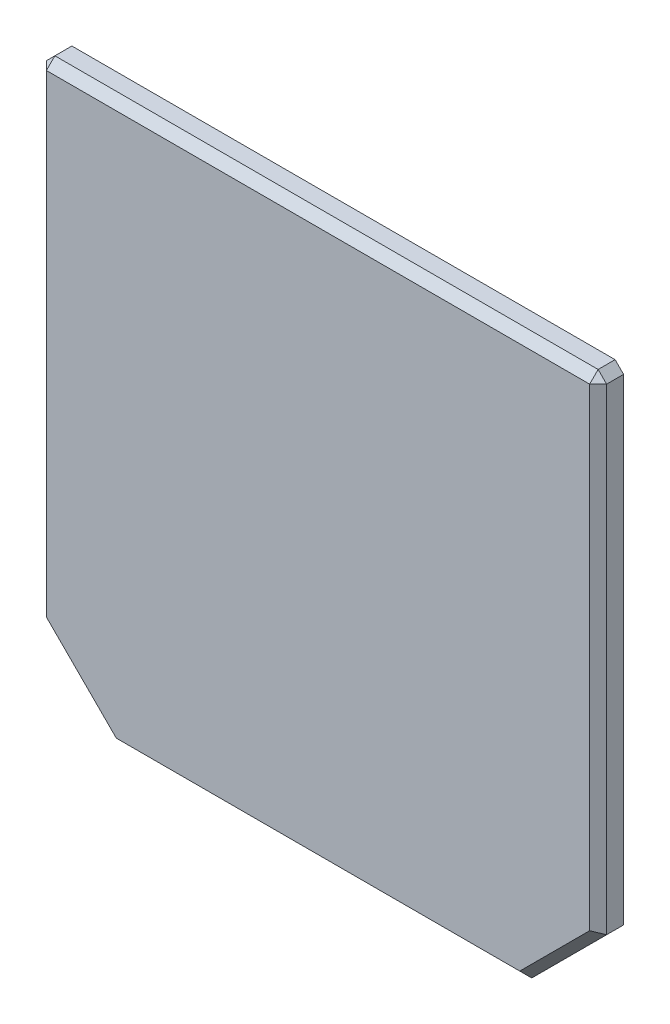
ISO-10303-21;
HEADER;
FILE_DESCRIPTION(('STEP AP214'),'2;1');
FILE_NAME('part.step','',(''),(''),'','','');
FILE_SCHEMA(('AUTOMOTIVE_DESIGN { 1 0 10303 214 1 1 1 1 }'));
ENDSEC;
DATA;
#1=APPLICATION_CONTEXT('core data for automotive mechanical design processes');
#2=APPLICATION_PROTOCOL_DEFINITION('international standard','automotive_design',2000,#1);
#3=PRODUCT_CONTEXT('',#1,'mechanical');
#4=PRODUCT('Part','Part','',(#3));
#5=PRODUCT_RELATED_PRODUCT_CATEGORY('part','',(#4));
#6=PRODUCT_DEFINITION_FORMATION('','',#4);
#7=PRODUCT_DEFINITION_CONTEXT('part definition',#1,'design');
#8=PRODUCT_DEFINITION('design','',#6,#7);
#9=PRODUCT_DEFINITION_SHAPE('','',#8);
#10=(LENGTH_UNIT() NAMED_UNIT(*) SI_UNIT(.MILLI.,.METRE.));
#11=(NAMED_UNIT(*) PLANE_ANGLE_UNIT() SI_UNIT($,.RADIAN.));
#12=(NAMED_UNIT(*) SI_UNIT($,.STERADIAN.) SOLID_ANGLE_UNIT());
#13=UNCERTAINTY_MEASURE_WITH_UNIT(LENGTH_MEASURE(1.E-05),#10,'distance_accuracy_value','');
#14=(GEOMETRIC_REPRESENTATION_CONTEXT(3) GLOBAL_UNCERTAINTY_ASSIGNED_CONTEXT((#13)) GLOBAL_UNIT_ASSIGNED_CONTEXT((#10,
#11,#12)) REPRESENTATION_CONTEXT('',''));
#15=CARTESIAN_POINT('',(0.,0.,0.));
#16=DIRECTION('',(0.,0.,1.));
#17=DIRECTION('',(1.,0.,0.));
#18=AXIS2_PLACEMENT_3D('',#15,#16,#17);
#19=CARTESIAN_POINT('',(0.,0.147174387247,0.));
#20=DIRECTION('',(0.,0.,-1.));
#21=DIRECTION('',(0.,-1.,0.));
#22=AXIS2_PLACEMENT_3D('',#19,#20,#21);
#23=PLANE('',#22);
#24=DIRECTION('',(0.923879532511276,-0.382683432365115,0.));
#25=VECTOR('',#24,1.);
#26=CARTESIAN_POINT('',(-1.980655035967,-3.439635777317,0.));
#27=LINE('',#26,#25);
#28=CARTESIAN_POINT('',(-2.488476301476,-3.229289321881,0.));
#29=VERTEX_POINT('',#28);
#30=CARTESIAN_POINT('',(-2.317765623357,-3.3,0.));
#31=VERTEX_POINT('',#30);
#32=EDGE_CURVE('E188',#29,#31,#27,.T.);
#33=ORIENTED_EDGE('',*,*,#32,.F.);
#34=DIRECTION('',(0.707106781186548,-0.707106781186548,0.));
#35=VECTOR('',#34,1.);
#36=CARTESIAN_POINT('',(-3.3,-2.417765623357,0.));
#37=LINE('',#36,#35);
#38=CARTESIAN_POINT('',(-3.3,-2.417765623357,0.));
#39=VERTEX_POINT('',#38);
#40=EDGE_CURVE('E160',#39,#29,#37,.T.);
#41=ORIENTED_EDGE('',*,*,#40,.F.);
#42=DIRECTION('',(0.,-1.,0.));
#43=VECTOR('',#42,1.);
#44=CARTESIAN_POINT('',(-3.3,3.3,0.));
#45=LINE('',#44,#43);
#46=CARTESIAN_POINT('',(-3.3,3.2,0.));
#47=VERTEX_POINT('',#46);
#48=EDGE_CURVE('E42',#47,#39,#45,.T.);
#49=ORIENTED_EDGE('',*,*,#48,.F.);
#50=DIRECTION('',(-0.707106781186548,-0.707106781186548,0.));
#51=VECTOR('',#50,1.);
#52=CARTESIAN_POINT('',(-3.213206403188,3.286793596812,0.));
#53=LINE('',#52,#51);
#54=CARTESIAN_POINT('',(-3.2,3.3,0.));
#55=VERTEX_POINT('',#54);
#56=EDGE_CURVE('E110',#55,#47,#53,.T.);
#57=ORIENTED_EDGE('',*,*,#56,.F.);
#58=DIRECTION('',(-1.,0.,0.));
#59=VECTOR('',#58,1.);
#60=CARTESIAN_POINT('',(3.3,3.3,0.));
#61=LINE('',#60,#59);
#62=CARTESIAN_POINT('',(3.2,3.3,0.));
#63=VERTEX_POINT('',#62);
#64=EDGE_CURVE('E28',#63,#55,#61,.T.);
#65=ORIENTED_EDGE('',*,*,#64,.F.);
#66=DIRECTION('',(-0.707106781186548,0.707106781186548,0.));
#67=VECTOR('',#66,1.);
#68=CARTESIAN_POINT('',(3.213206403188,3.286793596812,0.));
#69=LINE('',#68,#67);
#70=CARTESIAN_POINT('',(3.3,3.2,0.));
#71=VERTEX_POINT('',#70);
#72=EDGE_CURVE('E231',#71,#63,#69,.T.);
#73=ORIENTED_EDGE('',*,*,#72,.F.);
#74=DIRECTION('',(0.,1.,0.));
#75=VECTOR('',#74,1.);
#76=CARTESIAN_POINT('',(3.3,-2.417765623357,0.));
#77=LINE('',#76,#75);
#78=CARTESIAN_POINT('',(3.3,-2.417765623357,0.));
#79=VERTEX_POINT('',#78);
#80=EDGE_CURVE('E159',#79,#71,#77,.T.);
#81=ORIENTED_EDGE('',*,*,#80,.F.);
#82=DIRECTION('',(0.707106781186548,0.707106781186548,0.));
#83=VECTOR('',#82,1.);
#84=CARTESIAN_POINT('',(2.417765623357,-3.3,0.));
#85=LINE('',#84,#83);
#86=CARTESIAN_POINT('',(2.417765623357,-3.3,0.));
#87=VERTEX_POINT('',#86);
#88=EDGE_CURVE('E153',#87,#79,#85,.T.);
#89=ORIENTED_EDGE('',*,*,#88,.F.);
#90=DIRECTION('',(1.,0.,0.));
#91=VECTOR('',#90,1.);
#92=CARTESIAN_POINT('',(-2.417765623357,-3.3,0.));
#93=LINE('',#92,#91);
#94=EDGE_CURVE('E11',#31,#87,#93,.T.);
#95=ORIENTED_EDGE('',*,*,#94,.F.);
#96=EDGE_LOOP('',(#33,#41,#49,#57,#65,#73,#81,#89,#95));
#97=FACE_BOUND('',#96,.T.);
#98=ADVANCED_FACE('F17',(#97),#23,.T.);
#99=CARTESIAN_POINT('',(-2.417765623357,-3.3,0.300000011921));
#100=DIRECTION('',(0.,-1.,0.));
#101=DIRECTION('',(0.,0.,-1.));
#102=AXIS2_PLACEMENT_3D('',#99,#100,#101);
#103=PLANE('',#102);
#104=DIRECTION('',(0.,0.,1.));
#105=VECTOR('',#104,1.);
#106=CARTESIAN_POINT('',(-2.317765623357,-3.3,0.300000011921));
#107=LINE('',#106,#105);
#108=CARTESIAN_POINT('',(-2.317765623357,-3.3,0.200000011921));
#109=VERTEX_POINT('',#108);
#110=EDGE_CURVE('E191',#31,#109,#107,.T.);
#111=ORIENTED_EDGE('',*,*,#110,.F.);
#112=ORIENTED_EDGE('',*,*,#94,.T.);
#113=DIRECTION('',(0.,0.,-1.));
#114=VECTOR('',#113,1.);
#115=CARTESIAN_POINT('',(2.417765623357,-3.3,0.300000011921));
#116=LINE('',#115,#114);
#117=CARTESIAN_POINT('',(2.417765623357,-3.3,0.200000011921));
#118=VERTEX_POINT('',#117);
#119=EDGE_CURVE('E149',#118,#87,#116,.T.);
#120=ORIENTED_EDGE('',*,*,#119,.F.);
#121=DIRECTION('',(1.,0.,0.));
#122=VECTOR('',#121,1.);
#123=CARTESIAN_POINT('',(-1.208882811679,-3.3,0.200000011921));
#124=LINE('',#123,#122);
#125=EDGE_CURVE('E182',#109,#118,#124,.T.);
#126=ORIENTED_EDGE('',*,*,#125,.F.);
#127=EDGE_LOOP('',(#111,#112,#120,#126));
#128=FACE_BOUND('',#127,.T.);
#129=ADVANCED_FACE('F331',(#128),#103,.T.);
#130=CARTESIAN_POINT('',(3.3,3.3,0.300000011921));
#131=DIRECTION('',(0.,1.,0.));
#132=DIRECTION('',(0.,0.,-1.));
#133=AXIS2_PLACEMENT_3D('',#130,#131,#132);
#134=PLANE('',#133);
#135=DIRECTION('',(0.,0.,1.));
#136=VECTOR('',#135,1.);
#137=CARTESIAN_POINT('',(3.2,3.3,0.300000011921));
#138=LINE('',#137,#136);
#139=CARTESIAN_POINT('',(3.2,3.3,0.200000011921));
#140=VERTEX_POINT('',#139);
#141=EDGE_CURVE('E227',#63,#140,#138,.T.);
#142=ORIENTED_EDGE('',*,*,#141,.F.);
#143=ORIENTED_EDGE('',*,*,#64,.T.);
#144=DIRECTION('',(0.,0.,-1.));
#145=VECTOR('',#144,1.);
#146=CARTESIAN_POINT('',(-3.2,3.3,0.300000011921));
#147=LINE('',#146,#145);
#148=CARTESIAN_POINT('',(-3.2,3.3,0.200000011921));
#149=VERTEX_POINT('',#148);
#150=EDGE_CURVE('E113',#149,#55,#147,.T.);
#151=ORIENTED_EDGE('',*,*,#150,.F.);
#152=DIRECTION('',(-1.,0.,0.));
#153=VECTOR('',#152,1.);
#154=CARTESIAN_POINT('',(1.65,3.3,0.200000011921));
#155=LINE('',#154,#153);
#156=EDGE_CURVE('E123',#140,#149,#155,.T.);
#157=ORIENTED_EDGE('',*,*,#156,.F.);
#158=EDGE_LOOP('',(#142,#143,#151,#157));
#159=FACE_BOUND('',#158,.T.);
#160=ADVANCED_FACE('F461',(#159),#134,.T.);
#161=CARTESIAN_POINT('',(3.3,-2.417765623357,0.300000011921));
#162=DIRECTION('',(1.,0.,0.));
#163=DIRECTION('',(0.,0.,1.));
#164=AXIS2_PLACEMENT_3D('',#161,#162,#163);
#165=PLANE('',#164);
#166=DIRECTION('',(0.,1.,0.));
#167=VECTOR('',#166,1.);
#168=CARTESIAN_POINT('',(3.3,-1.135295618055,0.200000011921));
#169=LINE('',#168,#167);
#170=CARTESIAN_POINT('',(3.3,-2.417765623357,0.200000011921));
#171=VERTEX_POINT('',#170);
#172=CARTESIAN_POINT('',(3.3,3.2,0.200000011921));
#173=VERTEX_POINT('',#172);
#174=EDGE_CURVE('E170',#171,#173,#169,.T.);
#175=ORIENTED_EDGE('',*,*,#174,.F.);
#176=DIRECTION('',(0.,0.,-1.));
#177=VECTOR('',#176,1.);
#178=CARTESIAN_POINT('',(3.3,-2.417765623357,0.300000011921));
#179=LINE('',#178,#177);
#180=EDGE_CURVE('E176',#171,#79,#179,.T.);
#181=ORIENTED_EDGE('',*,*,#180,.T.);
#182=ORIENTED_EDGE('',*,*,#80,.T.);
#183=DIRECTION('',(0.,0.,-1.));
#184=VECTOR('',#183,1.);
#185=CARTESIAN_POINT('',(3.3,3.2,0.300000011921));
#186=LINE('',#185,#184);
#187=EDGE_CURVE('E156',#173,#71,#186,.T.);
#188=ORIENTED_EDGE('',*,*,#187,.F.);
#189=EDGE_LOOP('',(#175,#181,#182,#188));
#190=FACE_BOUND('',#189,.T.);
#191=ADVANCED_FACE('F638',(#190),#165,.T.);
#192=CARTESIAN_POINT('',(-3.3,3.3,0.300000011921));
#193=DIRECTION('',(-1.,0.,0.));
#194=DIRECTION('',(0.,1.,0.));
#195=AXIS2_PLACEMENT_3D('',#192,#193,#194);
#196=PLANE('',#195);
#197=DIRECTION('',(0.,-1.,0.));
#198=VECTOR('',#197,1.);
#199=CARTESIAN_POINT('',(-3.3,1.723587193623,0.200000011921));
#200=LINE('',#199,#198);
#201=CARTESIAN_POINT('',(-3.3,3.2,0.200000011921));
#202=VERTEX_POINT('',#201);
#203=CARTESIAN_POINT('',(-3.3,-2.417765623357,0.200000011921));
#204=VERTEX_POINT('',#203);
#205=EDGE_CURVE('E126',#202,#204,#200,.T.);
#206=ORIENTED_EDGE('',*,*,#205,.F.);
#207=DIRECTION('',(0.,0.,1.));
#208=VECTOR('',#207,1.);
#209=CARTESIAN_POINT('',(-3.3,3.2,0.300000011921));
#210=LINE('',#209,#208);
#211=EDGE_CURVE('E103',#47,#202,#210,.T.);
#212=ORIENTED_EDGE('',*,*,#211,.F.);
#213=ORIENTED_EDGE('',*,*,#48,.T.);
#214=DIRECTION('',(0.,0.,-1.));
#215=VECTOR('',#214,1.);
#216=CARTESIAN_POINT('',(-3.3,-2.417765623357,0.300000011921));
#217=LINE('',#216,#215);
#218=EDGE_CURVE('E128',#204,#39,#217,.T.);
#219=ORIENTED_EDGE('',*,*,#218,.F.);
#220=EDGE_LOOP('',(#206,#212,#213,#219));
#221=FACE_BOUND('',#220,.T.);
#222=ADVANCED_FACE('F19',(#221),#196,.T.);
#223=CARTESIAN_POINT('',(-3.3,-2.417765623357,0.300000011921));
#224=DIRECTION('',(-0.707106781186548,-0.707106781186548,0.));
#225=DIRECTION('',(-0.707106781186548,0.707106781186548,0.));
#226=AXIS2_PLACEMENT_3D('',#223,#224,#225);
#227=PLANE('',#226);
#228=DIRECTION('',(0.707106781186548,-0.707106781186548,0.));
#229=VECTOR('',#228,1.);
#230=CARTESIAN_POINT('',(-3.116235002651,-2.601530620706,0.200000011921));
#231=LINE('',#230,#229);
#232=CARTESIAN_POINT('',(-2.488476301476,-3.229289321881,0.200000011921));
#233=VERTEX_POINT('',#232);
#234=EDGE_CURVE('E198',#204,#233,#231,.T.);
#235=ORIENTED_EDGE('',*,*,#234,.F.);
#236=ORIENTED_EDGE('',*,*,#218,.T.);
#237=ORIENTED_EDGE('',*,*,#40,.T.);
#238=DIRECTION('',(0.,0.,-1.));
#239=VECTOR('',#238,1.);
#240=CARTESIAN_POINT('',(-2.488476301476,-3.229289321881,0.300000011921));
#241=LINE('',#240,#239);
#242=EDGE_CURVE('E143',#233,#29,#241,.T.);
#243=ORIENTED_EDGE('',*,*,#242,.F.);
#244=EDGE_LOOP('',(#235,#236,#237,#243));
#245=FACE_BOUND('',#244,.T.);
#246=ADVANCED_FACE('F465',(#245),#227,.T.);
#247=CARTESIAN_POINT('',(-3.25,3.25,0.300000011921));
#248=DIRECTION('',(-0.707106781186548,0.707106781186548,0.));
#249=DIRECTION('',(0.,0.,1.));
#250=AXIS2_PLACEMENT_3D('',#247,#248,#249);
#251=PLANE('',#250);
#252=ORIENTED_EDGE('',*,*,#56,.T.);
#253=ORIENTED_EDGE('',*,*,#211,.T.);
#254=DIRECTION('',(0.707106781186548,0.707106781186548,0.));
#255=VECTOR('',#254,1.);
#256=CARTESIAN_POINT('',(-3.3,3.2,0.200000011921));
#257=LINE('',#256,#255);
#258=EDGE_CURVE('E107',#202,#149,#257,.T.);
#259=ORIENTED_EDGE('',*,*,#258,.T.);
#260=ORIENTED_EDGE('',*,*,#150,.T.);
#261=EDGE_LOOP('',(#252,#253,#259,#260));
#262=FACE_BOUND('',#261,.T.);
#263=ADVANCED_FACE('F105',(#262),#251,.T.);
#264=CARTESIAN_POINT('',(1.65,3.25,0.250000011921));
#265=DIRECTION('',(0.,0.707106781186548,0.707106781186548));
#266=DIRECTION('',(1.,0.,0.));
#267=AXIS2_PLACEMENT_3D('',#264,#265,#266);
#268=PLANE('',#267);
#269=DIRECTION('',(0.,-0.707106781186548,0.707106781186548));
#270=VECTOR('',#269,1.);
#271=CARTESIAN_POINT('',(-3.2,3.3,0.200000011921));
#272=LINE('',#271,#270);
#273=CARTESIAN_POINT('',(-3.2,3.2,0.300000011921));
#274=VERTEX_POINT('',#273);
#275=EDGE_CURVE('E121',#149,#274,#272,.T.);
#276=ORIENTED_EDGE('',*,*,#275,.T.);
#277=DIRECTION('',(1.,0.,0.));
#278=VECTOR('',#277,1.);
#279=CARTESIAN_POINT('',(1.65,3.2,0.300000011921));
#280=LINE('',#279,#278);
#281=CARTESIAN_POINT('',(3.2,3.2,0.300000011921));
#282=VERTEX_POINT('',#281);
#283=EDGE_CURVE('E209',#274,#282,#280,.T.);
#284=ORIENTED_EDGE('',*,*,#283,.T.);
#285=DIRECTION('',(0.,0.707106781186548,-0.707106781186548));
#286=VECTOR('',#285,1.);
#287=CARTESIAN_POINT('',(3.2,3.2,0.300000011921));
#288=LINE('',#287,#286);
#289=EDGE_CURVE('E147',#282,#140,#288,.T.);
#290=ORIENTED_EDGE('',*,*,#289,.T.);
#291=ORIENTED_EDGE('',*,*,#156,.T.);
#292=EDGE_LOOP('',(#276,#284,#290,#291));
#293=FACE_BOUND('',#292,.T.);
#294=ADVANCED_FACE('F493',(#293),#268,.T.);
#295=CARTESIAN_POINT('',(-3.2,3.3,0.200000011921));
#296=DIRECTION('',(-0.577350269189626,0.577350269189626,0.577350269189626));
#297=DIRECTION('',(0.707106781186548,0.,0.707106781186548));
#298=AXIS2_PLACEMENT_3D('',#295,#296,#297);
#299=PLANE('',#298);
#300=DIRECTION('',(-0.707106781186548,0.,-0.707106781186548));
#301=VECTOR('',#300,1.);
#302=CARTESIAN_POINT('',(-3.2,3.2,0.300000011921));
#303=LINE('',#302,#301);
#304=EDGE_CURVE('E119',#274,#202,#303,.T.);
#305=ORIENTED_EDGE('',*,*,#304,.F.);
#306=ORIENTED_EDGE('',*,*,#275,.F.);
#307=ORIENTED_EDGE('',*,*,#258,.F.);
#308=EDGE_LOOP('',(#305,#306,#307));
#309=FACE_BOUND('',#308,.T.);
#310=ADVANCED_FACE('F117',(#309),#299,.T.);
#311=CARTESIAN_POINT('',(3.25,3.25,0.300000011921));
#312=DIRECTION('',(0.707106781186548,0.707106781186548,0.));
#313=DIRECTION('',(0.,0.,-1.));
#314=AXIS2_PLACEMENT_3D('',#311,#312,#313);
#315=PLANE('',#314);
#316=ORIENTED_EDGE('',*,*,#72,.T.);
#317=ORIENTED_EDGE('',*,*,#141,.T.);
#318=DIRECTION('',(0.707106781186548,-0.707106781186548,0.));
#319=VECTOR('',#318,1.);
#320=CARTESIAN_POINT('',(3.2,3.3,0.200000011921));
#321=LINE('',#320,#319);
#322=EDGE_CURVE('E166',#140,#173,#321,.T.);
#323=ORIENTED_EDGE('',*,*,#322,.T.);
#324=ORIENTED_EDGE('',*,*,#187,.T.);
#325=EDGE_LOOP('',(#316,#317,#323,#324));
#326=FACE_BOUND('',#325,.T.);
#327=ADVANCED_FACE('F492',(#326),#315,.T.);
#328=CARTESIAN_POINT('',(3.25,-1.135295618055,0.250000011921));
#329=DIRECTION('',(0.707106781186548,0.,0.707106781186548));
#330=DIRECTION('',(0.,-1.,0.));
#331=AXIS2_PLACEMENT_3D('',#328,#329,#330);
#332=PLANE('',#331);
#333=DIRECTION('',(-0.678598344545825,0.281084637714927,0.678598344545825));
#334=VECTOR('',#333,1.);
#335=CARTESIAN_POINT('',(3.047357320697,-2.313117599156,0.452642691224));
#336=LINE('',#335,#334);
#337=CARTESIAN_POINT('',(3.2,-2.37634426712,0.300000011921));
#338=VERTEX_POINT('',#337);
#339=EDGE_CURVE('E275',#171,#338,#336,.T.);
#340=ORIENTED_EDGE('',*,*,#339,.F.);
#341=ORIENTED_EDGE('',*,*,#174,.T.);
#342=DIRECTION('',(-0.707106781186548,0.,0.707106781186548));
#343=VECTOR('',#342,1.);
#344=CARTESIAN_POINT('',(3.3,3.2,0.200000011921));
#345=LINE('',#344,#343);
#346=EDGE_CURVE('E163',#173,#282,#345,.T.);
#347=ORIENTED_EDGE('',*,*,#346,.T.);
#348=DIRECTION('',(0.,-1.,0.));
#349=VECTOR('',#348,1.);
#350=CARTESIAN_POINT('',(3.2,-1.135295618055,0.300000011921));
#351=LINE('',#350,#349);
#352=EDGE_CURVE('E133',#282,#338,#351,.T.);
#353=ORIENTED_EDGE('',*,*,#352,.T.);
#354=EDGE_LOOP('',(#340,#341,#347,#353));
#355=FACE_BOUND('',#354,.T.);
#356=ADVANCED_FACE('F288',(#355),#332,.T.);
#357=CARTESIAN_POINT('',(3.3,3.2,0.200000011921));
#358=DIRECTION('',(0.577350269189626,0.577350269189626,0.577350269189626));
#359=DIRECTION('',(0.,0.707106781186548,-0.707106781186548));
#360=AXIS2_PLACEMENT_3D('',#357,#358,#359);
#361=PLANE('',#360);
#362=ORIENTED_EDGE('',*,*,#289,.F.);
#363=ORIENTED_EDGE('',*,*,#346,.F.);
#364=ORIENTED_EDGE('',*,*,#322,.F.);
#365=EDGE_LOOP('',(#362,#363,#364));
#366=FACE_BOUND('',#365,.T.);
#367=ADVANCED_FACE('F497',(#366),#361,.T.);
#368=CARTESIAN_POINT('',(0.,0.147174387247,0.300000011921));
#369=DIRECTION('',(0.,0.,-1.));
#370=DIRECTION('',(0.,-1.,0.));
#371=AXIS2_PLACEMENT_3D('',#368,#369,#370);
#372=PLANE('',#371);
#373=DIRECTION('',(-0.707106781186548,-0.707106781186548,0.));
#374=VECTOR('',#373,1.);
#375=CARTESIAN_POINT('',(2.604407136211,-2.971937130909,0.300000011921));
#376=LINE('',#375,#374);
#377=CARTESIAN_POINT('',(2.37634426712,-3.2,0.300000011921));
#378=VERTEX_POINT('',#377);
#379=EDGE_CURVE('E204',#338,#378,#376,.T.);
#380=ORIENTED_EDGE('',*,*,#379,.F.);
#381=ORIENTED_EDGE('',*,*,#352,.F.);
#382=ORIENTED_EDGE('',*,*,#283,.F.);
#383=DIRECTION('',(0.,1.,0.));
#384=VECTOR('',#383,1.);
#385=CARTESIAN_POINT('',(-3.2,1.723587193623,0.300000011921));
#386=LINE('',#385,#384);
#387=CARTESIAN_POINT('',(-3.2,-2.37634426712,0.300000011921));
#388=VERTEX_POINT('',#387);
#389=EDGE_CURVE('E136',#388,#274,#386,.T.);
#390=ORIENTED_EDGE('',*,*,#389,.F.);
#391=DIRECTION('',(-0.707106781186548,0.707106781186548,0.));
#392=VECTOR('',#391,1.);
#393=CARTESIAN_POINT('',(-3.045524324532,-2.530819942588,0.300000011921));
#394=LINE('',#393,#392);
#395=CARTESIAN_POINT('',(-2.37634426712,-3.2,0.300000011921));
#396=VERTEX_POINT('',#395);
#397=EDGE_CURVE('E192',#396,#388,#394,.T.);
#398=ORIENTED_EDGE('',*,*,#397,.F.);
#399=DIRECTION('',(-1.,0.,0.));
#400=VECTOR('',#399,1.);
#401=CARTESIAN_POINT('',(-1.208882811679,-3.2,0.300000011921));
#402=LINE('',#401,#400);
#403=EDGE_CURVE('E181',#378,#396,#402,.T.);
#404=ORIENTED_EDGE('',*,*,#403,.F.);
#405=EDGE_LOOP('',(#380,#381,#382,#390,#398,#404));
#406=FACE_BOUND('',#405,.T.);
#407=ADVANCED_FACE('F317',(#406),#372,.F.);
#408=CARTESIAN_POINT('',(-3.25,1.723587193623,0.250000011921));
#409=DIRECTION('',(-0.707106781186548,0.,0.707106781186548));
#410=DIRECTION('',(0.,1.,0.));
#411=AXIS2_PLACEMENT_3D('',#408,#409,#410);
#412=PLANE('',#411);
#413=DIRECTION('',(-0.678598344545825,-0.281084637714927,-0.678598344545825));
#414=VECTOR('',#413,1.);
#415=CARTESIAN_POINT('',(-2.834196717601,-2.22482358639,0.66580329432));
#416=LINE('',#415,#414);
#417=EDGE_CURVE('E194',#388,#204,#416,.T.);
#418=ORIENTED_EDGE('',*,*,#417,.F.);
#419=ORIENTED_EDGE('',*,*,#389,.T.);
#420=ORIENTED_EDGE('',*,*,#304,.T.);
#421=ORIENTED_EDGE('',*,*,#205,.T.);
#422=EDGE_LOOP('',(#418,#419,#420,#421));
#423=FACE_BOUND('',#422,.T.);
#424=ADVANCED_FACE('F135',(#423),#412,.T.);
#425=CARTESIAN_POINT('',(-2.403120962417,-3.264644660941,0.300000011921));
#426=DIRECTION('',(-0.382683432365115,-0.923879532511276,0.));
#427=DIRECTION('',(-0.923879532511276,0.382683432365115,0.));
#428=AXIS2_PLACEMENT_3D('',#425,#426,#427);
#429=PLANE('',#428);
#430=ORIENTED_EDGE('',*,*,#32,.T.);
#431=ORIENTED_EDGE('',*,*,#110,.T.);
#432=DIRECTION('',(-0.923879532511276,0.382683432365115,0.));
#433=VECTOR('',#432,1.);
#434=CARTESIAN_POINT('',(-2.317765623357,-3.3,0.200000011921));
#435=LINE('',#434,#433);
#436=EDGE_CURVE('E199',#109,#233,#435,.T.);
#437=ORIENTED_EDGE('',*,*,#436,.T.);
#438=ORIENTED_EDGE('',*,*,#242,.T.);
#439=EDGE_LOOP('',(#430,#431,#437,#438));
#440=FACE_BOUND('',#439,.T.);
#441=ADVANCED_FACE('F468',(#440),#429,.T.);
#442=CARTESIAN_POINT('',(-3.080879663592,-2.566175281647,0.250000011921));
#443=DIRECTION('',(-0.49999999999984,-0.49999999999984,0.707106781186774));
#444=DIRECTION('',(-0.707106781186548,0.707106781186548,0.));
#445=AXIS2_PLACEMENT_3D('',#442,#443,#444);
#446=PLANE('',#445);
#447=ORIENTED_EDGE('',*,*,#417,.T.);
#448=ORIENTED_EDGE('',*,*,#234,.T.);
#449=DIRECTION('',(0.732537816329167,0.191341716180337,0.653281482438358));
#450=VECTOR('',#449,1.);
#451=CARTESIAN_POINT('',(-2.488476301476,-3.229289321881,0.200000011921));
#452=LINE('',#451,#450);
#453=EDGE_CURVE('E186',#233,#396,#452,.T.);
#454=ORIENTED_EDGE('',*,*,#453,.T.);
#455=ORIENTED_EDGE('',*,*,#397,.T.);
#456=EDGE_LOOP('',(#447,#448,#454,#455));
#457=FACE_BOUND('',#456,.T.);
#458=ADVANCED_FACE('F321',(#457),#446,.T.);
#459=CARTESIAN_POINT('',(-2.37634426712,-3.2,0.300000011921));
#460=DIRECTION('',(-0.31354937721993,-0.75697515895783,0.573302186255871));
#461=DIRECTION('',(-0.923879532511258,0.38268343236516,0.));
#462=AXIS2_PLACEMENT_3D('',#459,#460,#461);
#463=PLANE('',#462);
#464=DIRECTION('',(0.382683432366817,-0.653281482437681,-0.653281482437684));
#465=VECTOR('',#464,1.);
#466=CARTESIAN_POINT('',(-2.37634426712,-3.2,0.300000011921));
#467=LINE('',#466,#465);
#468=EDGE_CURVE('E187',#396,#109,#467,.T.);
#469=ORIENTED_EDGE('',*,*,#468,.F.);
#470=ORIENTED_EDGE('',*,*,#453,.F.);
#471=ORIENTED_EDGE('',*,*,#436,.F.);
#472=EDGE_LOOP('',(#469,#470,#471));
#473=FACE_BOUND('',#472,.T.);
#474=ADVANCED_FACE('F324',(#473),#463,.T.);
#475=CARTESIAN_POINT('',(-1.208882811679,-3.25,0.250000011921));
#476=DIRECTION('',(0.,-0.707106781186548,0.707106781186548));
#477=DIRECTION('',(-1.,0.,0.));
#478=AXIS2_PLACEMENT_3D('',#475,#476,#477);
#479=PLANE('',#478);
#480=DIRECTION('',(0.281084637714927,-0.678598344545825,-0.678598344545825));
#481=VECTOR('',#480,1.);
#482=CARTESIAN_POINT('',(2.241045483498,-2.873359841608,0.626640170313));
#483=LINE('',#482,#481);
#484=EDGE_CURVE('E200',#378,#118,#483,.T.);
#485=ORIENTED_EDGE('',*,*,#484,.F.);
#486=ORIENTED_EDGE('',*,*,#403,.T.);
#487=ORIENTED_EDGE('',*,*,#468,.T.);
#488=ORIENTED_EDGE('',*,*,#125,.T.);
#489=EDGE_LOOP('',(#485,#486,#487,#488));
#490=FACE_BOUND('',#489,.T.);
#491=ADVANCED_FACE('F327',(#490),#479,.T.);
#492=CARTESIAN_POINT('',(2.417765623357,-3.3,0.300000011921));
#493=DIRECTION('',(0.707106781186548,-0.707106781186548,0.));
#494=DIRECTION('',(0.,0.,-1.));
#495=AXIS2_PLACEMENT_3D('',#492,#493,#494);
#496=PLANE('',#495);
#497=DIRECTION('',(0.707106781186548,0.707106781186548,0.));
#498=VECTOR('',#497,1.);
#499=CARTESIAN_POINT('',(2.67511781433,-3.042647809028,0.200000011921));
#500=LINE('',#499,#498);
#501=EDGE_CURVE('E21',#118,#171,#500,.T.);
#502=ORIENTED_EDGE('',*,*,#501,.F.);
#503=ORIENTED_EDGE('',*,*,#119,.T.);
#504=ORIENTED_EDGE('',*,*,#88,.T.);
#505=ORIENTED_EDGE('',*,*,#180,.F.);
#506=EDGE_LOOP('',(#502,#503,#504,#505));
#507=FACE_BOUND('',#506,.T.);
#508=ADVANCED_FACE('F333',(#507),#496,.T.);
#509=CARTESIAN_POINT('',(2.63976247527,-3.007292469968,0.250000011921));
#510=DIRECTION('',(0.49999999999984,-0.49999999999984,0.707106781186774));
#511=DIRECTION('',(-0.707106781186548,-0.707106781186548,0.));
#512=AXIS2_PLACEMENT_3D('',#509,#510,#511);
#513=PLANE('',#512);
#514=ORIENTED_EDGE('',*,*,#339,.T.);
#515=ORIENTED_EDGE('',*,*,#379,.T.);
#516=ORIENTED_EDGE('',*,*,#484,.T.);
#517=ORIENTED_EDGE('',*,*,#501,.T.);
#518=EDGE_LOOP('',(#514,#515,#516,#517));
#519=FACE_BOUND('',#518,.T.);
#520=ADVANCED_FACE('F283',(#519),#513,.T.);
#521=CLOSED_SHELL('',(#98,#129,#160,#191,#222,#246,#263,#294,#310,#327,#356,#367,#407,#424,#441,
#458,#474,#491,#508,#520));
#522=MANIFOLD_SOLID_BREP('B1',#521);
#523=ADVANCED_BREP_SHAPE_REPRESENTATION('',(#18,#522),#14);
#524=SHAPE_DEFINITION_REPRESENTATION(#9,#523);
ENDSEC;
END-ISO-10303-21;
